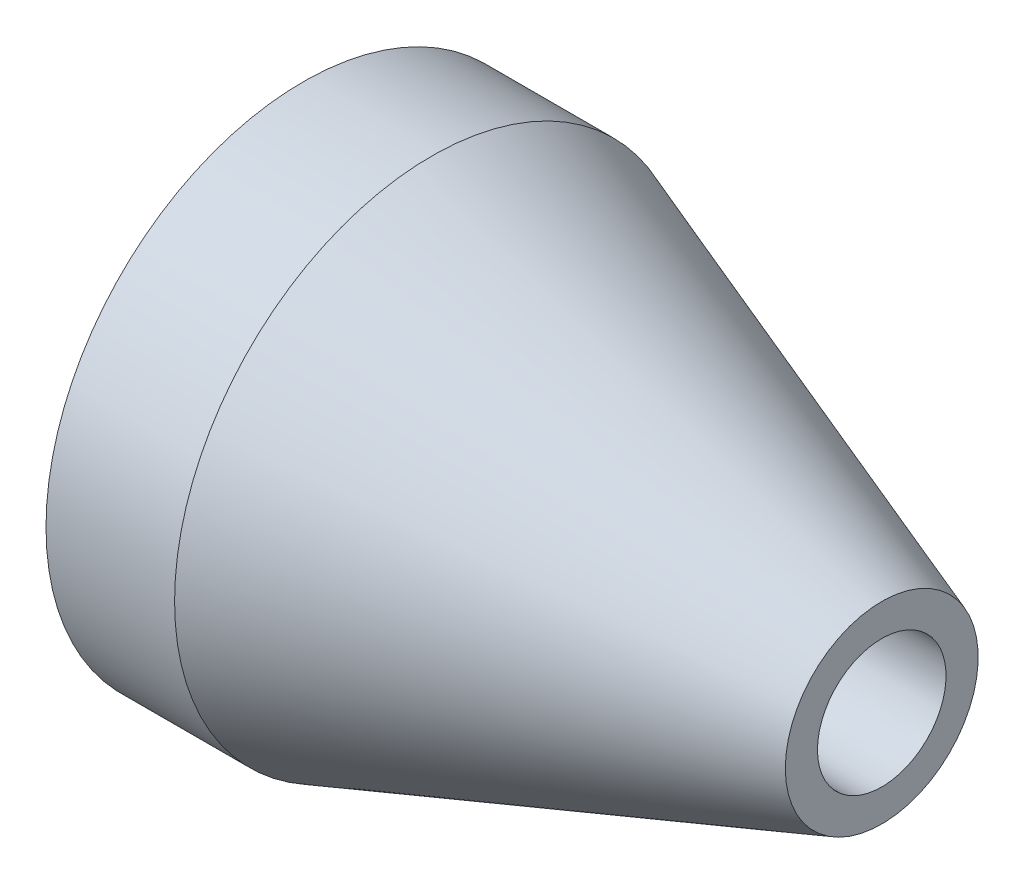
ISO-10303-21;
HEADER;
FILE_DESCRIPTION(('STEP AP214'),'2;1');
FILE_NAME('part.step','',(''),(''),'','','');
FILE_SCHEMA(('AUTOMOTIVE_DESIGN { 1 0 10303 214 1 1 1 1 }'));
ENDSEC;
DATA;
#1=APPLICATION_CONTEXT('core data for automotive mechanical design processes');
#2=APPLICATION_PROTOCOL_DEFINITION('international standard','automotive_design',2000,#1);
#3=PRODUCT_CONTEXT('',#1,'mechanical');
#4=PRODUCT('Part','Part','',(#3));
#5=PRODUCT_RELATED_PRODUCT_CATEGORY('part','',(#4));
#6=PRODUCT_DEFINITION_FORMATION('','',#4);
#7=PRODUCT_DEFINITION_CONTEXT('part definition',#1,'design');
#8=PRODUCT_DEFINITION('design','',#6,#7);
#9=PRODUCT_DEFINITION_SHAPE('','',#8);
#10=(LENGTH_UNIT() NAMED_UNIT(*) SI_UNIT(.MILLI.,.METRE.));
#11=(NAMED_UNIT(*) PLANE_ANGLE_UNIT() SI_UNIT($,.RADIAN.));
#12=(NAMED_UNIT(*) SI_UNIT($,.STERADIAN.) SOLID_ANGLE_UNIT());
#13=UNCERTAINTY_MEASURE_WITH_UNIT(LENGTH_MEASURE(1.E-05),#10,'distance_accuracy_value','');
#14=(GEOMETRIC_REPRESENTATION_CONTEXT(3) GLOBAL_UNCERTAINTY_ASSIGNED_CONTEXT((#13)) GLOBAL_UNIT_ASSIGNED_CONTEXT((#10,
#11,#12)) REPRESENTATION_CONTEXT('',''));
#15=CARTESIAN_POINT('',(0.,0.,0.));
#16=DIRECTION('',(0.,0.,1.));
#17=DIRECTION('',(1.,0.,0.));
#18=AXIS2_PLACEMENT_3D('',#15,#16,#17);
#19=CARTESIAN_POINT('',(0.,0.,0.));
#20=DIRECTION('',(-1.,0.,0.));
#21=DIRECTION('',(0.,0.,1.));
#22=AXIS2_PLACEMENT_3D('',#19,#20,#21);
#23=CYLINDRICAL_SURFACE('',#22,20.);
#24=CARTESIAN_POINT('',(10.,0.,0.));
#25=DIRECTION('',(-1.,0.,0.));
#26=DIRECTION('',(0.,0.,1.));
#27=AXIS2_PLACEMENT_3D('',#24,#25,#26);
#28=CIRCLE('',#27,20.);
#29=CARTESIAN_POINT('',(10.,0.,20.));
#30=VERTEX_POINT('',#29);
#31=EDGE_CURVE('E10',#30,#30,#28,.T.);
#32=ORIENTED_EDGE('',*,*,#31,.T.);
#33=EDGE_LOOP('',(#32));
#34=FACE_BOUND('',#33,.T.);
#35=CARTESIAN_POINT('',(0.,0.,0.));
#36=DIRECTION('',(-1.,0.,0.));
#37=DIRECTION('',(0.,0.,1.));
#38=AXIS2_PLACEMENT_3D('',#35,#36,#37);
#39=CIRCLE('',#38,20.);
#40=CARTESIAN_POINT('',(0.,0.,20.));
#41=VERTEX_POINT('',#40);
#42=EDGE_CURVE('E50',#41,#41,#39,.T.);
#43=ORIENTED_EDGE('',*,*,#42,.F.);
#44=EDGE_LOOP('',(#43));
#45=FACE_BOUND('',#44,.T.);
#46=ADVANCED_FACE('F31',(#34,#45),#23,.T.);
#47=CARTESIAN_POINT('',(10.,0.,0.));
#48=DIRECTION('',(-1.,0.,0.));
#49=DIRECTION('',(0.,0.,1.));
#50=AXIS2_PLACEMENT_3D('',#47,#48,#49);
#51=CONICAL_SURFACE('',#50,20.,0.343023940420703);
#52=CARTESIAN_POINT('',(45.,0.,0.));
#53=DIRECTION('',(-1.,0.,0.));
#54=DIRECTION('',(0.,0.,1.));
#55=AXIS2_PLACEMENT_3D('',#52,#53,#54);
#56=CIRCLE('',#55,7.5);
#57=CARTESIAN_POINT('',(45.,0.,7.5));
#58=VERTEX_POINT('',#57);
#59=EDGE_CURVE('E37',#58,#58,#56,.T.);
#60=ORIENTED_EDGE('',*,*,#59,.T.);
#61=EDGE_LOOP('',(#60));
#62=FACE_BOUND('',#61,.T.);
#63=ORIENTED_EDGE('',*,*,#31,.F.);
#64=EDGE_LOOP('',(#63));
#65=FACE_BOUND('',#64,.T.);
#66=ADVANCED_FACE('F58',(#62,#65),#51,.T.);
#67=CARTESIAN_POINT('',(45.,-7.5,0.));
#68=DIRECTION('',(1.,0.,0.));
#69=DIRECTION('',(0.,0.,-1.));
#70=AXIS2_PLACEMENT_3D('',#67,#68,#69);
#71=PLANE('',#70);
#72=CARTESIAN_POINT('',(45.,0.,0.));
#73=DIRECTION('',(-1.,0.,0.));
#74=DIRECTION('',(0.,0.,1.));
#75=AXIS2_PLACEMENT_3D('',#72,#73,#74);
#76=CIRCLE('',#75,5.);
#77=CARTESIAN_POINT('',(45.,0.,5.));
#78=VERTEX_POINT('',#77);
#79=EDGE_CURVE('E41',#78,#78,#76,.T.);
#80=ORIENTED_EDGE('',*,*,#79,.T.);
#81=EDGE_LOOP('',(#80));
#82=FACE_BOUND('',#81,.T.);
#83=ORIENTED_EDGE('',*,*,#59,.F.);
#84=EDGE_LOOP('',(#83));
#85=FACE_BOUND('',#84,.T.);
#86=ADVANCED_FACE('F62',(#82,#85),#71,.T.);
#87=CARTESIAN_POINT('',(0.,0.,0.));
#88=DIRECTION('',(-1.,0.,0.));
#89=DIRECTION('',(0.,0.,1.));
#90=AXIS2_PLACEMENT_3D('',#87,#88,#89);
#91=CYLINDRICAL_SURFACE('',#90,5.);
#92=CARTESIAN_POINT('',(0.,0.,0.));
#93=DIRECTION('',(-1.,0.,0.));
#94=DIRECTION('',(0.,0.,1.));
#95=AXIS2_PLACEMENT_3D('',#92,#93,#94);
#96=CIRCLE('',#95,5.);
#97=CARTESIAN_POINT('',(0.,0.,5.));
#98=VERTEX_POINT('',#97);
#99=EDGE_CURVE('E45',#98,#98,#96,.T.);
#100=ORIENTED_EDGE('',*,*,#99,.T.);
#101=EDGE_LOOP('',(#100));
#102=FACE_BOUND('',#101,.T.);
#103=ORIENTED_EDGE('',*,*,#79,.F.);
#104=EDGE_LOOP('',(#103));
#105=FACE_BOUND('',#104,.T.);
#106=ADVANCED_FACE('F66',(#102,#105),#91,.F.);
#107=CARTESIAN_POINT('',(0.,-7.5,0.));
#108=DIRECTION('',(-1.,0.,0.));
#109=DIRECTION('',(0.,0.,1.));
#110=AXIS2_PLACEMENT_3D('',#107,#108,#109);
#111=PLANE('',#110);
#112=ORIENTED_EDGE('',*,*,#42,.T.);
#113=EDGE_LOOP('',(#112));
#114=FACE_BOUND('',#113,.T.);
#115=ORIENTED_EDGE('',*,*,#99,.F.);
#116=EDGE_LOOP('',(#115));
#117=FACE_BOUND('',#116,.T.);
#118=ADVANCED_FACE('F54',(#114,#117),#111,.T.);
#119=CLOSED_SHELL('',(#46,#66,#86,#106,#118));
#120=MANIFOLD_SOLID_BREP('B2',#119);
#121=ADVANCED_BREP_SHAPE_REPRESENTATION('',(#18,#120),#14);
#122=SHAPE_DEFINITION_REPRESENTATION(#9,#121);
ENDSEC;
END-ISO-10303-21;
